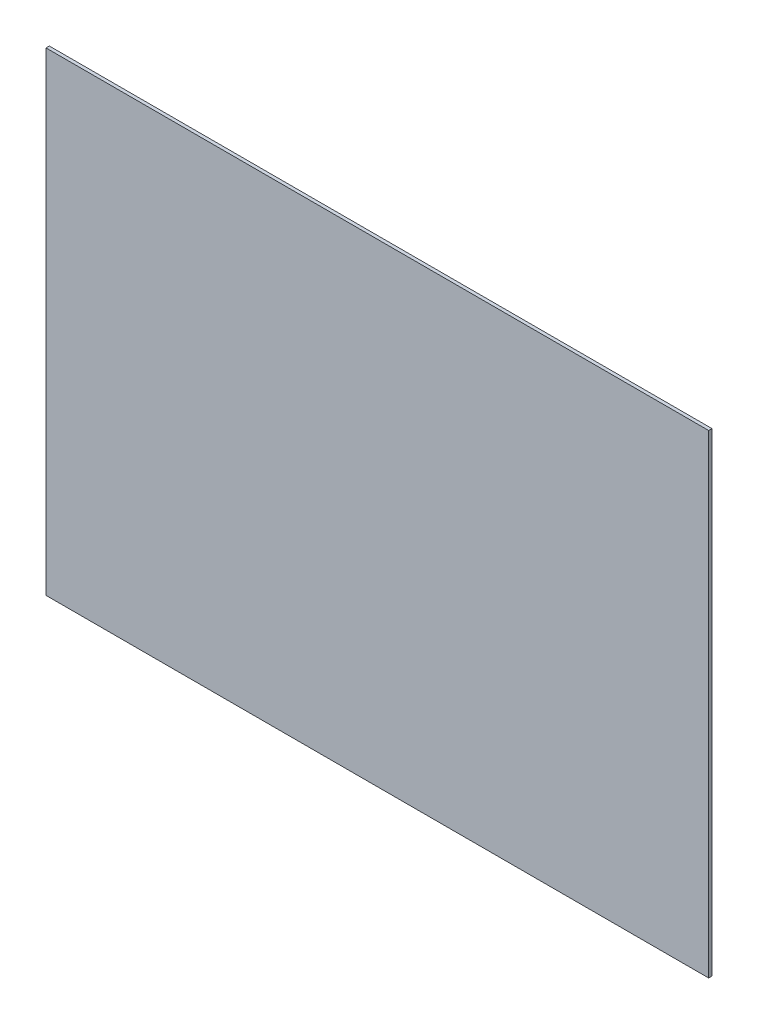
ISO-10303-21;
HEADER;
FILE_DESCRIPTION(('STEP AP214'),'2;1');
FILE_NAME('part.step','',(''),(''),'','','');
FILE_SCHEMA(('AUTOMOTIVE_DESIGN { 1 0 10303 214 1 1 1 1 }'));
ENDSEC;
DATA;
#1=APPLICATION_CONTEXT('core data for automotive mechanical design processes');
#2=APPLICATION_PROTOCOL_DEFINITION('international standard','automotive_design',2000,#1);
#3=PRODUCT_CONTEXT('',#1,'mechanical');
#4=PRODUCT('Part','Part','',(#3));
#5=PRODUCT_RELATED_PRODUCT_CATEGORY('part','',(#4));
#6=PRODUCT_DEFINITION_FORMATION('','',#4);
#7=PRODUCT_DEFINITION_CONTEXT('part definition',#1,'design');
#8=PRODUCT_DEFINITION('design','',#6,#7);
#9=PRODUCT_DEFINITION_SHAPE('','',#8);
#10=(LENGTH_UNIT() NAMED_UNIT(*) SI_UNIT(.MILLI.,.METRE.));
#11=(NAMED_UNIT(*) PLANE_ANGLE_UNIT() SI_UNIT($,.RADIAN.));
#12=(NAMED_UNIT(*) SI_UNIT($,.STERADIAN.) SOLID_ANGLE_UNIT());
#13=UNCERTAINTY_MEASURE_WITH_UNIT(LENGTH_MEASURE(1.E-05),#10,'distance_accuracy_value','');
#14=(GEOMETRIC_REPRESENTATION_CONTEXT(3) GLOBAL_UNCERTAINTY_ASSIGNED_CONTEXT((#13)) GLOBAL_UNIT_ASSIGNED_CONTEXT((#10,
#11,#12)) REPRESENTATION_CONTEXT('',''));
#15=CARTESIAN_POINT('',(0.,0.,0.));
#16=DIRECTION('',(0.,0.,1.));
#17=DIRECTION('',(1.,0.,0.));
#18=AXIS2_PLACEMENT_3D('',#15,#16,#17);
#19=CARTESIAN_POINT('',(2.5544535961954,-0.231524540639564,0.));
#20=DIRECTION('',(0.,1.,0.));
#21=DIRECTION('',(-1.,0.,0.));
#22=AXIS2_PLACEMENT_3D('',#19,#20,#21);
#23=PLANE('',#22);
#24=DIRECTION('',(1.,0.,0.));
#25=VECTOR('',#24,1.);
#26=CARTESIAN_POINT('',(2.5345236394027,-0.231524540639564,0.));
#27=LINE('',#26,#25);
#28=CARTESIAN_POINT('',(2.5345236394027,-0.231524540639564,0.));
#29=VERTEX_POINT('',#28);
#30=CARTESIAN_POINT('',(2.5544535961954,-0.231524540639564,0.));
#31=VERTEX_POINT('',#30);
#32=EDGE_CURVE('E11',#29,#31,#27,.T.);
#33=ORIENTED_EDGE('',*,*,#32,.F.);
#34=DIRECTION('',(0.,0.,1.));
#35=VECTOR('',#34,1.);
#36=CARTESIAN_POINT('',(2.5345236394027,-0.231524540639564,0.));
#37=LINE('',#36,#35);
#38=CARTESIAN_POINT('',(2.5345236394027,-0.231524540639564,0.0001));
#39=VERTEX_POINT('',#38);
#40=EDGE_CURVE('E24',#29,#39,#37,.T.);
#41=ORIENTED_EDGE('',*,*,#40,.T.);
#42=DIRECTION('',(-1.,0.,0.));
#43=VECTOR('',#42,1.);
#44=CARTESIAN_POINT('',(2.5345236394027,-0.231524540639564,0.0001));
#45=LINE('',#44,#43);
#46=CARTESIAN_POINT('',(2.5544535961954,-0.231524540639564,0.0001));
#47=VERTEX_POINT('',#46);
#48=EDGE_CURVE('E75',#47,#39,#45,.T.);
#49=ORIENTED_EDGE('',*,*,#48,.F.);
#50=DIRECTION('',(0.,0.,1.));
#51=VECTOR('',#50,1.);
#52=CARTESIAN_POINT('',(2.5544535961954,-0.231524540639564,0.));
#53=LINE('',#52,#51);
#54=EDGE_CURVE('E85',#31,#47,#53,.T.);
#55=ORIENTED_EDGE('',*,*,#54,.F.);
#56=EDGE_LOOP('',(#33,#41,#49,#55));
#57=FACE_BOUND('',#56,.T.);
#58=ADVANCED_FACE('F17',(#57),#23,.T.);
#59=CARTESIAN_POINT('',(2.5544535961954,-0.245785752106594,0.));
#60=DIRECTION('',(1.,0.,0.));
#61=DIRECTION('',(0.,1.,0.));
#62=AXIS2_PLACEMENT_3D('',#59,#60,#61);
#63=PLANE('',#62);
#64=DIRECTION('',(0.,-1.,0.));
#65=VECTOR('',#64,1.);
#66=CARTESIAN_POINT('',(2.5544535961954,-0.231524540639564,0.));
#67=LINE('',#66,#65);
#68=CARTESIAN_POINT('',(2.5544535961954,-0.245785752106594,0.));
#69=VERTEX_POINT('',#68);
#70=EDGE_CURVE('E83',#31,#69,#67,.T.);
#71=ORIENTED_EDGE('',*,*,#70,.F.);
#72=ORIENTED_EDGE('',*,*,#54,.T.);
#73=DIRECTION('',(0.,1.,0.));
#74=VECTOR('',#73,1.);
#75=CARTESIAN_POINT('',(2.5544535961954,-0.231524540639564,0.0001));
#76=LINE('',#75,#74);
#77=CARTESIAN_POINT('',(2.5544535961954,-0.245785752106594,0.0001));
#78=VERTEX_POINT('',#77);
#79=EDGE_CURVE('E81',#78,#47,#76,.T.);
#80=ORIENTED_EDGE('',*,*,#79,.F.);
#81=DIRECTION('',(0.,0.,1.));
#82=VECTOR('',#81,1.);
#83=CARTESIAN_POINT('',(2.5544535961954,-0.245785752106594,0.));
#84=LINE('',#83,#82);
#85=EDGE_CURVE('E61',#69,#78,#84,.T.);
#86=ORIENTED_EDGE('',*,*,#85,.F.);
#87=EDGE_LOOP('',(#71,#72,#80,#86));
#88=FACE_BOUND('',#87,.T.);
#89=ADVANCED_FACE('F91',(#88),#63,.T.);
#90=CARTESIAN_POINT('',(2.5345236394027,-0.245785752106594,0.));
#91=DIRECTION('',(0.,-1.,0.));
#92=DIRECTION('',(1.,0.,0.));
#93=AXIS2_PLACEMENT_3D('',#90,#91,#92);
#94=PLANE('',#93);
#95=DIRECTION('',(-1.,0.,0.));
#96=VECTOR('',#95,1.);
#97=CARTESIAN_POINT('',(2.5544535961954,-0.245785752106594,0.));
#98=LINE('',#97,#96);
#99=CARTESIAN_POINT('',(2.5345236394027,-0.245785752106594,0.));
#100=VERTEX_POINT('',#99);
#101=EDGE_CURVE('E65',#69,#100,#98,.T.);
#102=ORIENTED_EDGE('',*,*,#101,.F.);
#103=ORIENTED_EDGE('',*,*,#85,.T.);
#104=DIRECTION('',(1.,0.,0.));
#105=VECTOR('',#104,1.);
#106=CARTESIAN_POINT('',(2.5544535961954,-0.245785752106594,0.0001));
#107=LINE('',#106,#105);
#108=CARTESIAN_POINT('',(2.5345236394027,-0.245785752106594,0.0001));
#109=VERTEX_POINT('',#108);
#110=EDGE_CURVE('E54',#109,#78,#107,.T.);
#111=ORIENTED_EDGE('',*,*,#110,.F.);
#112=DIRECTION('',(0.,0.,1.));
#113=VECTOR('',#112,1.);
#114=CARTESIAN_POINT('',(2.5345236394027,-0.245785752106594,0.));
#115=LINE('',#114,#113);
#116=EDGE_CURVE('E58',#100,#109,#115,.T.);
#117=ORIENTED_EDGE('',*,*,#116,.F.);
#118=EDGE_LOOP('',(#102,#103,#111,#117));
#119=FACE_BOUND('',#118,.T.);
#120=ADVANCED_FACE('F57',(#119),#94,.T.);
#121=CARTESIAN_POINT('',(2.5345236394027,-0.231524540639564,0.));
#122=DIRECTION('',(-1.,0.,0.));
#123=DIRECTION('',(0.,-1.,0.));
#124=AXIS2_PLACEMENT_3D('',#121,#122,#123);
#125=PLANE('',#124);
#126=DIRECTION('',(0.,1.,0.));
#127=VECTOR('',#126,1.);
#128=CARTESIAN_POINT('',(2.5345236394027,-0.245785752106594,0.));
#129=LINE('',#128,#127);
#130=EDGE_CURVE('E71',#100,#29,#129,.T.);
#131=ORIENTED_EDGE('',*,*,#130,.F.);
#132=ORIENTED_EDGE('',*,*,#116,.T.);
#133=DIRECTION('',(0.,-1.,0.));
#134=VECTOR('',#133,1.);
#135=CARTESIAN_POINT('',(2.5345236394027,-0.245785752106594,0.0001));
#136=LINE('',#135,#134);
#137=EDGE_CURVE('E70',#39,#109,#136,.T.);
#138=ORIENTED_EDGE('',*,*,#137,.F.);
#139=ORIENTED_EDGE('',*,*,#40,.F.);
#140=EDGE_LOOP('',(#131,#132,#138,#139));
#141=FACE_BOUND('',#140,.T.);
#142=ADVANCED_FACE('F69',(#141),#125,.T.);
#143=CARTESIAN_POINT('',(2.544488617799,-0.238655146373079,0.));
#144=DIRECTION('',(0.,0.,1.));
#145=DIRECTION('',(1.,0.,0.));
#146=AXIS2_PLACEMENT_3D('',#143,#144,#145);
#147=PLANE('',#146);
#148=ORIENTED_EDGE('',*,*,#130,.T.);
#149=ORIENTED_EDGE('',*,*,#32,.T.);
#150=ORIENTED_EDGE('',*,*,#70,.T.);
#151=ORIENTED_EDGE('',*,*,#101,.T.);
#152=EDGE_LOOP('',(#148,#149,#150,#151));
#153=FACE_BOUND('',#152,.T.);
#154=ADVANCED_FACE('F88',(#153),#147,.F.);
#155=CARTESIAN_POINT('',(2.544488617799,-0.238655146373079,0.0001));
#156=DIRECTION('',(0.,0.,1.));
#157=DIRECTION('',(1.,0.,0.));
#158=AXIS2_PLACEMENT_3D('',#155,#156,#157);
#159=PLANE('',#158);
#160=ORIENTED_EDGE('',*,*,#137,.T.);
#161=ORIENTED_EDGE('',*,*,#110,.T.);
#162=ORIENTED_EDGE('',*,*,#79,.T.);
#163=ORIENTED_EDGE('',*,*,#48,.T.);
#164=EDGE_LOOP('',(#160,#161,#162,#163));
#165=FACE_BOUND('',#164,.T.);
#166=ADVANCED_FACE('F74',(#165),#159,.T.);
#167=CLOSED_SHELL('',(#58,#89,#120,#142,#154,#166));
#168=MANIFOLD_SOLID_BREP('B1',#167);
#169=ADVANCED_BREP_SHAPE_REPRESENTATION('',(#18,#168),#14);
#170=SHAPE_DEFINITION_REPRESENTATION(#9,#169);
ENDSEC;
END-ISO-10303-21;
